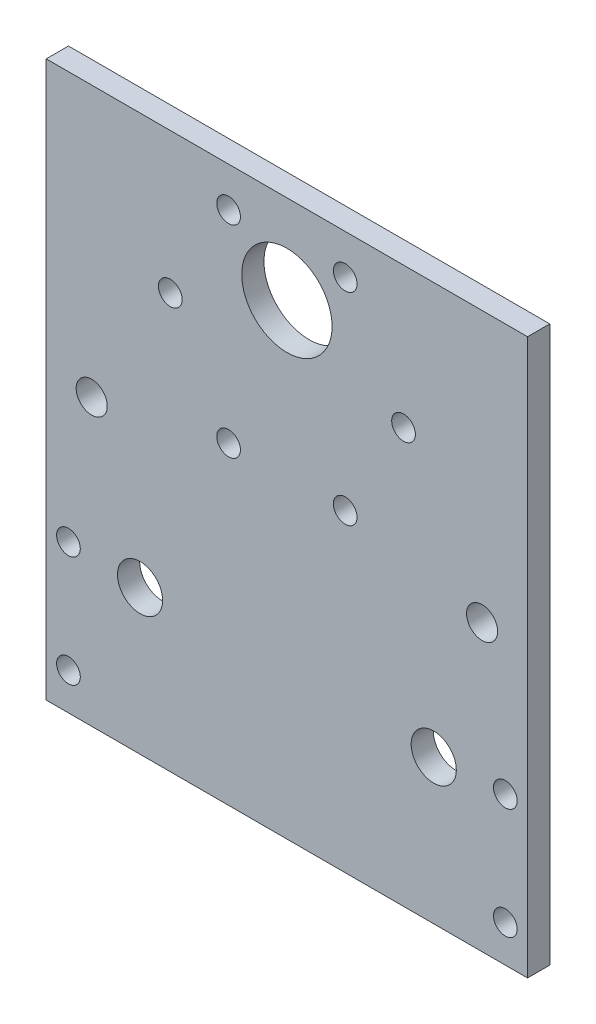
ISO-10303-21;
HEADER;
FILE_DESCRIPTION(('STEP AP214'),'2;1');
FILE_NAME('part.step','',(''),(''),'','','');
FILE_SCHEMA(('AUTOMOTIVE_DESIGN { 1 0 10303 214 1 1 1 1 }'));
ENDSEC;
DATA;
#1=APPLICATION_CONTEXT('core data for automotive mechanical design processes');
#2=APPLICATION_PROTOCOL_DEFINITION('international standard','automotive_design',2000,#1);
#3=PRODUCT_CONTEXT('',#1,'mechanical');
#4=PRODUCT('Part','Part','',(#3));
#5=PRODUCT_RELATED_PRODUCT_CATEGORY('part','',(#4));
#6=PRODUCT_DEFINITION_FORMATION('','',#4);
#7=PRODUCT_DEFINITION_CONTEXT('part definition',#1,'design');
#8=PRODUCT_DEFINITION('design','',#6,#7);
#9=PRODUCT_DEFINITION_SHAPE('','',#8);
#10=(LENGTH_UNIT() NAMED_UNIT(*) SI_UNIT(.MILLI.,.METRE.));
#11=(NAMED_UNIT(*) PLANE_ANGLE_UNIT() SI_UNIT($,.RADIAN.));
#12=(NAMED_UNIT(*) SI_UNIT($,.STERADIAN.) SOLID_ANGLE_UNIT());
#13=UNCERTAINTY_MEASURE_WITH_UNIT(LENGTH_MEASURE(1.E-05),#10,'distance_accuracy_value','');
#14=(GEOMETRIC_REPRESENTATION_CONTEXT(3) GLOBAL_UNCERTAINTY_ASSIGNED_CONTEXT((#13)) GLOBAL_UNIT_ASSIGNED_CONTEXT((#10,
#11,#12)) REPRESENTATION_CONTEXT('',''));
#15=CARTESIAN_POINT('',(0.,0.,0.));
#16=DIRECTION('',(0.,0.,1.));
#17=DIRECTION('',(1.,0.,0.));
#18=AXIS2_PLACEMENT_3D('',#15,#16,#17);
#19=CARTESIAN_POINT('',(32.5,0.,3.));
#20=DIRECTION('',(1.,0.,0.));
#21=DIRECTION('',(0.,0.,-1.));
#22=AXIS2_PLACEMENT_3D('',#19,#20,#21);
#23=PLANE('',#22);
#24=DIRECTION('',(0.,-1.,0.));
#25=VECTOR('',#24,1.);
#26=CARTESIAN_POINT('',(32.5,0.,0.));
#27=LINE('',#26,#25);
#28=CARTESIAN_POINT('',(32.5,62.5,0.));
#29=VERTEX_POINT('',#28);
#30=CARTESIAN_POINT('',(32.5,-12.5,0.));
#31=VERTEX_POINT('',#30);
#32=EDGE_CURVE('E159',#29,#31,#27,.T.);
#33=ORIENTED_EDGE('',*,*,#32,.F.);
#34=DIRECTION('',(0.,0.,-1.));
#35=VECTOR('',#34,1.);
#36=CARTESIAN_POINT('',(32.5,62.5,3.));
#37=LINE('',#36,#35);
#38=CARTESIAN_POINT('',(32.5,62.5,3.));
#39=VERTEX_POINT('',#38);
#40=EDGE_CURVE('E108',#39,#29,#37,.T.);
#41=ORIENTED_EDGE('',*,*,#40,.F.);
#42=DIRECTION('',(0.,-1.,0.));
#43=VECTOR('',#42,1.);
#44=CARTESIAN_POINT('',(32.5,0.,3.));
#45=LINE('',#44,#43);
#46=CARTESIAN_POINT('',(32.5,-12.5,3.));
#47=VERTEX_POINT('',#46);
#48=EDGE_CURVE('E99',#39,#47,#45,.T.);
#49=ORIENTED_EDGE('',*,*,#48,.T.);
#50=DIRECTION('',(0.,0.,-1.));
#51=VECTOR('',#50,1.);
#52=CARTESIAN_POINT('',(32.5,-12.5,3.));
#53=LINE('',#52,#51);
#54=EDGE_CURVE('E58',#47,#31,#53,.T.);
#55=ORIENTED_EDGE('',*,*,#54,.T.);
#56=EDGE_LOOP('',(#33,#41,#49,#55));
#57=FACE_BOUND('',#56,.T.);
#58=ADVANCED_FACE('F48',(#57),#23,.T.);
#59=CARTESIAN_POINT('',(-32.5,0.,3.));
#60=DIRECTION('',(1.,0.,0.));
#61=DIRECTION('',(0.,0.,-1.));
#62=AXIS2_PLACEMENT_3D('',#59,#60,#61);
#63=PLANE('',#62);
#64=DIRECTION('',(0.,-1.,0.));
#65=VECTOR('',#64,1.);
#66=CARTESIAN_POINT('',(-32.5,0.,0.));
#67=LINE('',#66,#65);
#68=CARTESIAN_POINT('',(-32.5,62.5,0.));
#69=VERTEX_POINT('',#68);
#70=CARTESIAN_POINT('',(-32.5,-12.5,0.));
#71=VERTEX_POINT('',#70);
#72=EDGE_CURVE('E82',#69,#71,#67,.T.);
#73=ORIENTED_EDGE('',*,*,#72,.T.);
#74=DIRECTION('',(0.,0.,-1.));
#75=VECTOR('',#74,1.);
#76=CARTESIAN_POINT('',(-32.5,-12.5,3.));
#77=LINE('',#76,#75);
#78=CARTESIAN_POINT('',(-32.5,-12.5,3.));
#79=VERTEX_POINT('',#78);
#80=EDGE_CURVE('E12',#79,#71,#77,.T.);
#81=ORIENTED_EDGE('',*,*,#80,.F.);
#82=DIRECTION('',(0.,-1.,0.));
#83=VECTOR('',#82,1.);
#84=CARTESIAN_POINT('',(-32.5,0.,3.));
#85=LINE('',#84,#83);
#86=CARTESIAN_POINT('',(-32.5,62.5,3.));
#87=VERTEX_POINT('',#86);
#88=EDGE_CURVE('E94',#87,#79,#85,.T.);
#89=ORIENTED_EDGE('',*,*,#88,.F.);
#90=DIRECTION('',(0.,0.,1.));
#91=VECTOR('',#90,1.);
#92=CARTESIAN_POINT('',(-32.5,62.5,3.));
#93=LINE('',#92,#91);
#94=EDGE_CURVE('E98',#69,#87,#93,.T.);
#95=ORIENTED_EDGE('',*,*,#94,.F.);
#96=EDGE_LOOP('',(#73,#81,#89,#95));
#97=FACE_BOUND('',#96,.T.);
#98=ADVANCED_FACE('F96',(#97),#63,.F.);
#99=CARTESIAN_POINT('',(-19.83,7.,3.));
#100=DIRECTION('',(0.,0.,-1.));
#101=DIRECTION('',(-1.,0.,0.));
#102=AXIS2_PLACEMENT_3D('',#99,#100,#101);
#103=CYLINDRICAL_SURFACE('',#102,3.05);
#104=CARTESIAN_POINT('',(-19.83,7.,3.));
#105=DIRECTION('',(0.,0.,1.));
#106=DIRECTION('',(1.,0.,0.));
#107=AXIS2_PLACEMENT_3D('',#104,#105,#106);
#108=CIRCLE('',#107,3.05);
#109=CARTESIAN_POINT('',(-16.78,7.,3.));
#110=VERTEX_POINT('',#109);
#111=EDGE_CURVE('E149',#110,#110,#108,.T.);
#112=ORIENTED_EDGE('',*,*,#111,.T.);
#113=EDGE_LOOP('',(#112));
#114=FACE_BOUND('',#113,.T.);
#115=CARTESIAN_POINT('',(-19.83,7.,0.));
#116=DIRECTION('',(0.,0.,1.));
#117=DIRECTION('',(1.,0.,0.));
#118=AXIS2_PLACEMENT_3D('',#115,#116,#117);
#119=CIRCLE('',#118,3.05);
#120=CARTESIAN_POINT('',(-16.78,7.,0.));
#121=VERTEX_POINT('',#120);
#122=EDGE_CURVE('E156',#121,#121,#119,.T.);
#123=ORIENTED_EDGE('',*,*,#122,.F.);
#124=EDGE_LOOP('',(#123));
#125=FACE_BOUND('',#124,.T.);
#126=ADVANCED_FACE('F189',(#114,#125),#103,.F.);
#127=CARTESIAN_POINT('',(19.83,7.,3.));
#128=DIRECTION('',(0.,0.,-1.));
#129=DIRECTION('',(-1.,0.,0.));
#130=AXIS2_PLACEMENT_3D('',#127,#128,#129);
#131=CYLINDRICAL_SURFACE('',#130,3.05);
#132=CARTESIAN_POINT('',(19.83,7.,3.));
#133=DIRECTION('',(0.,0.,1.));
#134=DIRECTION('',(1.,0.,0.));
#135=AXIS2_PLACEMENT_3D('',#132,#133,#134);
#136=CIRCLE('',#135,3.05);
#137=CARTESIAN_POINT('',(22.88,7.,3.));
#138=VERTEX_POINT('',#137);
#139=EDGE_CURVE('E146',#138,#138,#136,.T.);
#140=ORIENTED_EDGE('',*,*,#139,.T.);
#141=EDGE_LOOP('',(#140));
#142=FACE_BOUND('',#141,.T.);
#143=CARTESIAN_POINT('',(19.83,7.,0.));
#144=DIRECTION('',(0.,0.,1.));
#145=DIRECTION('',(1.,0.,0.));
#146=AXIS2_PLACEMENT_3D('',#143,#144,#145);
#147=CIRCLE('',#146,3.05);
#148=CARTESIAN_POINT('',(22.88,7.,0.));
#149=VERTEX_POINT('',#148);
#150=EDGE_CURVE('E143',#149,#149,#147,.T.);
#151=ORIENTED_EDGE('',*,*,#150,.F.);
#152=EDGE_LOOP('',(#151));
#153=FACE_BOUND('',#152,.T.);
#154=ADVANCED_FACE('F50',(#142,#153),#131,.F.);
#155=CARTESIAN_POINT('',(0.,-12.5,3.));
#156=DIRECTION('',(0.,1.,0.));
#157=DIRECTION('',(-1.,0.,0.));
#158=AXIS2_PLACEMENT_3D('',#155,#156,#157);
#159=PLANE('',#158);
#160=DIRECTION('',(1.,0.,0.));
#161=VECTOR('',#160,1.);
#162=CARTESIAN_POINT('',(0.,-12.5,0.));
#163=LINE('',#162,#161);
#164=EDGE_CURVE('E77',#71,#31,#163,.T.);
#165=ORIENTED_EDGE('',*,*,#164,.T.);
#166=ORIENTED_EDGE('',*,*,#54,.F.);
#167=DIRECTION('',(1.,0.,0.));
#168=VECTOR('',#167,1.);
#169=CARTESIAN_POINT('',(0.,-12.5,3.));
#170=LINE('',#169,#168);
#171=EDGE_CURVE('E66',#79,#47,#170,.T.);
#172=ORIENTED_EDGE('',*,*,#171,.F.);
#173=ORIENTED_EDGE('',*,*,#80,.T.);
#174=EDGE_LOOP('',(#165,#166,#172,#173));
#175=FACE_BOUND('',#174,.T.);
#176=ADVANCED_FACE('F165',(#175),#159,.F.);
#177=CARTESIAN_POINT('',(0.,0.,3.));
#178=DIRECTION('',(0.,0.,1.));
#179=DIRECTION('',(1.,0.,0.));
#180=AXIS2_PLACEMENT_3D('',#177,#178,#179);
#181=PLANE('',#180);
#182=CARTESIAN_POINT('',(-26.36,26.,3.));
#183=DIRECTION('',(0.,0.,1.));
#184=DIRECTION('',(1.,0.,0.));
#185=AXIS2_PLACEMENT_3D('',#182,#183,#184);
#186=CIRCLE('',#185,2.1);
#187=CARTESIAN_POINT('',(-24.26,26.,3.));
#188=VERTEX_POINT('',#187);
#189=EDGE_CURVE('E358',#188,#188,#186,.T.);
#190=ORIENTED_EDGE('',*,*,#189,.F.);
#191=EDGE_LOOP('',(#190));
#192=FACE_BOUND('',#191,.T.);
#193=CARTESIAN_POINT('',(26.3608960252373,25.99999999999,3.));
#194=DIRECTION('',(0.,0.,1.));
#195=DIRECTION('',(1.,0.,0.));
#196=AXIS2_PLACEMENT_3D('',#193,#194,#195);
#197=CIRCLE('',#196,2.1);
#198=CARTESIAN_POINT('',(28.4608960252373,25.99999999999,3.));
#199=VERTEX_POINT('',#198);
#200=EDGE_CURVE('E362',#199,#199,#197,.T.);
#201=ORIENTED_EDGE('',*,*,#200,.F.);
#202=EDGE_LOOP('',(#201));
#203=FACE_BOUND('',#202,.T.);
#204=CARTESIAN_POINT('',(7.87500000000003,29.8600998903951,3.));
#205=DIRECTION('',(0.,0.,1.));
#206=DIRECTION('',(1.,0.,0.));
#207=AXIS2_PLACEMENT_3D('',#204,#205,#206);
#208=CIRCLE('',#207,1.6);
#209=CARTESIAN_POINT('',(9.47500000000003,29.8600998903951,3.));
#210=VERTEX_POINT('',#209);
#211=EDGE_CURVE('E112',#210,#210,#208,.F.);
#212=ORIENTED_EDGE('',*,*,#211,.T.);
#213=EDGE_LOOP('',(#212));
#214=FACE_BOUND('',#213,.T.);
#215=CARTESIAN_POINT('',(-7.87500000000001,29.8600998903951,3.));
#216=DIRECTION('',(0.,0.,1.));
#217=DIRECTION('',(1.,0.,0.));
#218=AXIS2_PLACEMENT_3D('',#215,#216,#217);
#219=CIRCLE('',#218,1.6);
#220=CARTESIAN_POINT('',(-6.27500000000001,29.8600998903951,3.));
#221=VERTEX_POINT('',#220);
#222=EDGE_CURVE('E115',#221,#221,#219,.F.);
#223=ORIENTED_EDGE('',*,*,#222,.T.);
#224=EDGE_LOOP('',(#223));
#225=FACE_BOUND('',#224,.T.);
#226=CARTESIAN_POINT('',(0.,50.5,3.));
#227=DIRECTION('',(0.,0.,1.));
#228=DIRECTION('',(1.,0.,0.));
#229=AXIS2_PLACEMENT_3D('',#226,#227,#228);
#230=CIRCLE('',#229,6.1);
#231=CARTESIAN_POINT('',(6.1,50.5,3.));
#232=VERTEX_POINT('',#231);
#233=EDGE_CURVE('E401',#232,#232,#230,.F.);
#234=ORIENTED_EDGE('',*,*,#233,.T.);
#235=EDGE_LOOP('',(#234));
#236=FACE_BOUND('',#235,.T.);
#237=CARTESIAN_POINT('',(-7.87499999999992,57.139900109605,3.));
#238=DIRECTION('',(0.,0.,1.));
#239=DIRECTION('',(1.,0.,0.));
#240=AXIS2_PLACEMENT_3D('',#237,#238,#239);
#241=CIRCLE('',#240,1.6);
#242=CARTESIAN_POINT('',(-6.27499999999992,57.139900109605,3.));
#243=VERTEX_POINT('',#242);
#244=EDGE_CURVE('E398',#243,#243,#241,.F.);
#245=ORIENTED_EDGE('',*,*,#244,.T.);
#246=EDGE_LOOP('',(#245));
#247=FACE_BOUND('',#246,.T.);
#248=CARTESIAN_POINT('',(-15.75,43.5,3.));
#249=DIRECTION('',(0.,0.,1.));
#250=DIRECTION('',(1.,0.,0.));
#251=AXIS2_PLACEMENT_3D('',#248,#249,#250);
#252=CIRCLE('',#251,1.6);
#253=CARTESIAN_POINT('',(-14.15,43.5,3.));
#254=VERTEX_POINT('',#253);
#255=EDGE_CURVE('E395',#254,#254,#252,.F.);
#256=ORIENTED_EDGE('',*,*,#255,.T.);
#257=EDGE_LOOP('',(#256));
#258=FACE_BOUND('',#257,.T.);
#259=CARTESIAN_POINT('',(15.75,43.5000000000001,3.));
#260=DIRECTION('',(0.,0.,1.));
#261=DIRECTION('',(1.,0.,0.));
#262=AXIS2_PLACEMENT_3D('',#259,#260,#261);
#263=CIRCLE('',#262,1.6);
#264=CARTESIAN_POINT('',(17.35,43.5000000000001,3.));
#265=VERTEX_POINT('',#264);
#266=EDGE_CURVE('E392',#265,#265,#263,.F.);
#267=ORIENTED_EDGE('',*,*,#266,.T.);
#268=EDGE_LOOP('',(#267));
#269=FACE_BOUND('',#268,.T.);
#270=CARTESIAN_POINT('',(7.87499999999992,57.139900109605,3.));
#271=DIRECTION('',(0.,0.,1.));
#272=DIRECTION('',(1.,0.,0.));
#273=AXIS2_PLACEMENT_3D('',#270,#271,#272);
#274=CIRCLE('',#273,1.6);
#275=CARTESIAN_POINT('',(9.47499999999992,57.139900109605,3.));
#276=VERTEX_POINT('',#275);
#277=EDGE_CURVE('E389',#276,#276,#274,.F.);
#278=ORIENTED_EDGE('',*,*,#277,.T.);
#279=EDGE_LOOP('',(#278));
#280=FACE_BOUND('',#279,.T.);
#281=CARTESIAN_POINT('',(-29.5,-7.5,3.));
#282=DIRECTION('',(0.,0.,1.));
#283=DIRECTION('',(1.,0.,0.));
#284=AXIS2_PLACEMENT_3D('',#281,#282,#283);
#285=CIRCLE('',#284,1.6);
#286=CARTESIAN_POINT('',(-27.9,-7.5,3.));
#287=VERTEX_POINT('',#286);
#288=EDGE_CURVE('E132',#287,#287,#285,.T.);
#289=ORIENTED_EDGE('',*,*,#288,.F.);
#290=EDGE_LOOP('',(#289));
#291=FACE_BOUND('',#290,.T.);
#292=CARTESIAN_POINT('',(29.5,7.5,3.));
#293=DIRECTION('',(0.,0.,1.));
#294=DIRECTION('',(1.,0.,0.));
#295=AXIS2_PLACEMENT_3D('',#292,#293,#294);
#296=CIRCLE('',#295,1.6);
#297=CARTESIAN_POINT('',(31.1,7.5,3.));
#298=VERTEX_POINT('',#297);
#299=EDGE_CURVE('E125',#298,#298,#296,.T.);
#300=ORIENTED_EDGE('',*,*,#299,.F.);
#301=EDGE_LOOP('',(#300));
#302=FACE_BOUND('',#301,.T.);
#303=CARTESIAN_POINT('',(29.5,-7.5,3.));
#304=DIRECTION('',(0.,0.,1.));
#305=DIRECTION('',(1.,0.,0.));
#306=AXIS2_PLACEMENT_3D('',#303,#304,#305);
#307=CIRCLE('',#306,1.6);
#308=CARTESIAN_POINT('',(31.1,-7.5,3.));
#309=VERTEX_POINT('',#308);
#310=EDGE_CURVE('E121',#309,#309,#307,.T.);
#311=ORIENTED_EDGE('',*,*,#310,.F.);
#312=EDGE_LOOP('',(#311));
#313=FACE_BOUND('',#312,.T.);
#314=CARTESIAN_POINT('',(-29.5,7.5,3.));
#315=DIRECTION('',(0.,0.,1.));
#316=DIRECTION('',(1.,0.,0.));
#317=AXIS2_PLACEMENT_3D('',#314,#315,#316);
#318=CIRCLE('',#317,1.6);
#319=CARTESIAN_POINT('',(-27.9,7.5,3.));
#320=VERTEX_POINT('',#319);
#321=EDGE_CURVE('E131',#320,#320,#318,.T.);
#322=ORIENTED_EDGE('',*,*,#321,.F.);
#323=EDGE_LOOP('',(#322));
#324=FACE_BOUND('',#323,.T.);
#325=ORIENTED_EDGE('',*,*,#139,.F.);
#326=EDGE_LOOP('',(#325));
#327=FACE_BOUND('',#326,.T.);
#328=ORIENTED_EDGE('',*,*,#111,.F.);
#329=EDGE_LOOP('',(#328));
#330=FACE_BOUND('',#329,.T.);
#331=ORIENTED_EDGE('',*,*,#48,.F.);
#332=DIRECTION('',(1.,0.,0.));
#333=VECTOR('',#332,1.);
#334=CARTESIAN_POINT('',(-32.5,62.5,3.));
#335=LINE('',#334,#333);
#336=EDGE_CURVE('E102',#87,#39,#335,.T.);
#337=ORIENTED_EDGE('',*,*,#336,.F.);
#338=ORIENTED_EDGE('',*,*,#88,.T.);
#339=ORIENTED_EDGE('',*,*,#171,.T.);
#340=EDGE_LOOP('',(#331,#337,#338,#339));
#341=FACE_BOUND('',#340,.T.);
#342=ADVANCED_FACE('F103',(#192,#203,#214,#225,#236,#247,#258,#269,#280,#291,#302,#313,#324,
#327,#330,#341),#181,.T.);
#343=CARTESIAN_POINT('',(0.,0.,0.));
#344=DIRECTION('',(0.,0.,1.));
#345=DIRECTION('',(1.,0.,0.));
#346=AXIS2_PLACEMENT_3D('',#343,#344,#345);
#347=PLANE('',#346);
#348=CARTESIAN_POINT('',(-26.36,26.,0.));
#349=DIRECTION('',(0.,0.,1.));
#350=DIRECTION('',(1.,0.,0.));
#351=AXIS2_PLACEMENT_3D('',#348,#349,#350);
#352=CIRCLE('',#351,2.1);
#353=CARTESIAN_POINT('',(-24.26,26.,0.));
#354=VERTEX_POINT('',#353);
#355=EDGE_CURVE('E52',#354,#354,#352,.T.);
#356=ORIENTED_EDGE('',*,*,#355,.T.);
#357=EDGE_LOOP('',(#356));
#358=FACE_BOUND('',#357,.T.);
#359=CARTESIAN_POINT('',(26.3608960252373,25.99999999999,0.));
#360=DIRECTION('',(0.,0.,-1.));
#361=DIRECTION('',(-1.,0.,0.));
#362=AXIS2_PLACEMENT_3D('',#359,#360,#361);
#363=CIRCLE('',#362,2.1);
#364=CARTESIAN_POINT('',(24.2608960252373,25.99999999999,0.));
#365=VERTEX_POINT('',#364);
#366=EDGE_CURVE('E360',#365,#365,#363,.T.);
#367=ORIENTED_EDGE('',*,*,#366,.F.);
#368=EDGE_LOOP('',(#367));
#369=FACE_BOUND('',#368,.T.);
#370=CARTESIAN_POINT('',(7.87500000000003,29.8600998903951,0.));
#371=DIRECTION('',(0.,0.,1.));
#372=DIRECTION('',(1.,0.,0.));
#373=AXIS2_PLACEMENT_3D('',#370,#371,#372);
#374=CIRCLE('',#373,1.6);
#375=CARTESIAN_POINT('',(9.47500000000003,29.8600998903951,0.));
#376=VERTEX_POINT('',#375);
#377=EDGE_CURVE('E368',#376,#376,#374,.T.);
#378=ORIENTED_EDGE('',*,*,#377,.T.);
#379=EDGE_LOOP('',(#378));
#380=FACE_BOUND('',#379,.T.);
#381=CARTESIAN_POINT('',(-7.87500000000001,29.8600998903951,0.));
#382=DIRECTION('',(0.,0.,1.));
#383=DIRECTION('',(1.,0.,0.));
#384=AXIS2_PLACEMENT_3D('',#381,#382,#383);
#385=CIRCLE('',#384,1.6);
#386=CARTESIAN_POINT('',(-6.27500000000001,29.8600998903951,0.));
#387=VERTEX_POINT('',#386);
#388=EDGE_CURVE('E376',#387,#387,#385,.T.);
#389=ORIENTED_EDGE('',*,*,#388,.T.);
#390=EDGE_LOOP('',(#389));
#391=FACE_BOUND('',#390,.T.);
#392=CARTESIAN_POINT('',(0.,50.5,0.));
#393=DIRECTION('',(0.,0.,1.));
#394=DIRECTION('',(1.,0.,0.));
#395=AXIS2_PLACEMENT_3D('',#392,#393,#394);
#396=CIRCLE('',#395,6.1);
#397=CARTESIAN_POINT('',(6.1,50.5,0.));
#398=VERTEX_POINT('',#397);
#399=EDGE_CURVE('E377',#398,#398,#396,.T.);
#400=ORIENTED_EDGE('',*,*,#399,.T.);
#401=EDGE_LOOP('',(#400));
#402=FACE_BOUND('',#401,.T.);
#403=CARTESIAN_POINT('',(-7.87499999999992,57.139900109605,0.));
#404=DIRECTION('',(0.,0.,1.));
#405=DIRECTION('',(1.,0.,0.));
#406=AXIS2_PLACEMENT_3D('',#403,#404,#405);
#407=CIRCLE('',#406,1.6);
#408=CARTESIAN_POINT('',(-6.27499999999992,57.139900109605,0.));
#409=VERTEX_POINT('',#408);
#410=EDGE_CURVE('E372',#409,#409,#407,.T.);
#411=ORIENTED_EDGE('',*,*,#410,.T.);
#412=EDGE_LOOP('',(#411));
#413=FACE_BOUND('',#412,.T.);
#414=CARTESIAN_POINT('',(-15.75,43.5,0.));
#415=DIRECTION('',(0.,0.,1.));
#416=DIRECTION('',(1.,0.,0.));
#417=AXIS2_PLACEMENT_3D('',#414,#415,#416);
#418=CIRCLE('',#417,1.6);
#419=CARTESIAN_POINT('',(-14.15,43.5,0.));
#420=VERTEX_POINT('',#419);
#421=EDGE_CURVE('E369',#420,#420,#418,.T.);
#422=ORIENTED_EDGE('',*,*,#421,.T.);
#423=EDGE_LOOP('',(#422));
#424=FACE_BOUND('',#423,.T.);
#425=CARTESIAN_POINT('',(15.75,43.5000000000001,0.));
#426=DIRECTION('',(0.,0.,1.));
#427=DIRECTION('',(1.,0.,0.));
#428=AXIS2_PLACEMENT_3D('',#425,#426,#427);
#429=CIRCLE('',#428,1.6);
#430=CARTESIAN_POINT('',(17.35,43.5000000000001,0.));
#431=VERTEX_POINT('',#430);
#432=EDGE_CURVE('E373',#431,#431,#429,.T.);
#433=ORIENTED_EDGE('',*,*,#432,.T.);
#434=EDGE_LOOP('',(#433));
#435=FACE_BOUND('',#434,.T.);
#436=CARTESIAN_POINT('',(7.87499999999992,57.139900109605,0.));
#437=DIRECTION('',(0.,0.,1.));
#438=DIRECTION('',(1.,0.,0.));
#439=AXIS2_PLACEMENT_3D('',#436,#437,#438);
#440=CIRCLE('',#439,1.6);
#441=CARTESIAN_POINT('',(9.47499999999992,57.139900109605,0.));
#442=VERTEX_POINT('',#441);
#443=EDGE_CURVE('E380',#442,#442,#440,.T.);
#444=ORIENTED_EDGE('',*,*,#443,.T.);
#445=EDGE_LOOP('',(#444));
#446=FACE_BOUND('',#445,.T.);
#447=CARTESIAN_POINT('',(-29.5,-7.5,0.));
#448=DIRECTION('',(0.,0.,1.));
#449=DIRECTION('',(1.,0.,0.));
#450=AXIS2_PLACEMENT_3D('',#447,#448,#449);
#451=CIRCLE('',#450,1.6);
#452=CARTESIAN_POINT('',(-27.9,-7.5,0.));
#453=VERTEX_POINT('',#452);
#454=EDGE_CURVE('E128',#453,#453,#451,.T.);
#455=ORIENTED_EDGE('',*,*,#454,.T.);
#456=EDGE_LOOP('',(#455));
#457=FACE_BOUND('',#456,.T.);
#458=CARTESIAN_POINT('',(29.5,7.5,0.));
#459=DIRECTION('',(0.,0.,1.));
#460=DIRECTION('',(1.,0.,0.));
#461=AXIS2_PLACEMENT_3D('',#458,#459,#460);
#462=CIRCLE('',#461,1.6);
#463=CARTESIAN_POINT('',(31.1,7.5,0.));
#464=VERTEX_POINT('',#463);
#465=EDGE_CURVE('E135',#464,#464,#462,.T.);
#466=ORIENTED_EDGE('',*,*,#465,.T.);
#467=EDGE_LOOP('',(#466));
#468=FACE_BOUND('',#467,.T.);
#469=CARTESIAN_POINT('',(29.5,-7.5,0.));
#470=DIRECTION('',(0.,0.,1.));
#471=DIRECTION('',(1.,0.,0.));
#472=AXIS2_PLACEMENT_3D('',#469,#470,#471);
#473=CIRCLE('',#472,1.6);
#474=CARTESIAN_POINT('',(31.1,-7.5,0.));
#475=VERTEX_POINT('',#474);
#476=EDGE_CURVE('E122',#475,#475,#473,.T.);
#477=ORIENTED_EDGE('',*,*,#476,.T.);
#478=EDGE_LOOP('',(#477));
#479=FACE_BOUND('',#478,.T.);
#480=CARTESIAN_POINT('',(-29.5,7.5,0.));
#481=DIRECTION('',(0.,0.,1.));
#482=DIRECTION('',(1.,0.,0.));
#483=AXIS2_PLACEMENT_3D('',#480,#481,#482);
#484=CIRCLE('',#483,1.6);
#485=CARTESIAN_POINT('',(-27.9,7.5,0.));
#486=VERTEX_POINT('',#485);
#487=EDGE_CURVE('E140',#486,#486,#484,.T.);
#488=ORIENTED_EDGE('',*,*,#487,.T.);
#489=EDGE_LOOP('',(#488));
#490=FACE_BOUND('',#489,.T.);
#491=ORIENTED_EDGE('',*,*,#150,.T.);
#492=EDGE_LOOP('',(#491));
#493=FACE_BOUND('',#492,.T.);
#494=ORIENTED_EDGE('',*,*,#122,.T.);
#495=EDGE_LOOP('',(#494));
#496=FACE_BOUND('',#495,.T.);
#497=ORIENTED_EDGE('',*,*,#32,.T.);
#498=ORIENTED_EDGE('',*,*,#164,.F.);
#499=ORIENTED_EDGE('',*,*,#72,.F.);
#500=DIRECTION('',(-1.,0.,0.));
#501=VECTOR('',#500,1.);
#502=CARTESIAN_POINT('',(-32.5,62.5,0.));
#503=LINE('',#502,#501);
#504=EDGE_CURVE('E111',#29,#69,#503,.T.);
#505=ORIENTED_EDGE('',*,*,#504,.F.);
#506=EDGE_LOOP('',(#497,#498,#499,#505));
#507=FACE_BOUND('',#506,.T.);
#508=ADVANCED_FACE('F166',(#358,#369,#380,#391,#402,#413,#424,#435,#446,#457,#468,#479,#490,
#493,#496,#507),#347,.F.);
#509=CARTESIAN_POINT('',(-29.5,7.5,0.));
#510=DIRECTION('',(0.,0.,1.));
#511=DIRECTION('',(1.,0.,0.));
#512=AXIS2_PLACEMENT_3D('',#509,#510,#511);
#513=CYLINDRICAL_SURFACE('',#512,1.6);
#514=ORIENTED_EDGE('',*,*,#487,.F.);
#515=EDGE_LOOP('',(#514));
#516=FACE_BOUND('',#515,.T.);
#517=ORIENTED_EDGE('',*,*,#321,.T.);
#518=EDGE_LOOP('',(#517));
#519=FACE_BOUND('',#518,.T.);
#520=ADVANCED_FACE('F168',(#516,#519),#513,.F.);
#521=CARTESIAN_POINT('',(29.5,-7.5,0.));
#522=DIRECTION('',(0.,0.,1.));
#523=DIRECTION('',(1.,0.,0.));
#524=AXIS2_PLACEMENT_3D('',#521,#522,#523);
#525=CYLINDRICAL_SURFACE('',#524,1.6);
#526=ORIENTED_EDGE('',*,*,#476,.F.);
#527=EDGE_LOOP('',(#526));
#528=FACE_BOUND('',#527,.T.);
#529=ORIENTED_EDGE('',*,*,#310,.T.);
#530=EDGE_LOOP('',(#529));
#531=FACE_BOUND('',#530,.T.);
#532=ADVANCED_FACE('F176',(#528,#531),#525,.F.);
#533=CARTESIAN_POINT('',(29.5,7.5,0.));
#534=DIRECTION('',(0.,0.,1.));
#535=DIRECTION('',(1.,0.,0.));
#536=AXIS2_PLACEMENT_3D('',#533,#534,#535);
#537=CYLINDRICAL_SURFACE('',#536,1.6);
#538=ORIENTED_EDGE('',*,*,#465,.F.);
#539=EDGE_LOOP('',(#538));
#540=FACE_BOUND('',#539,.T.);
#541=ORIENTED_EDGE('',*,*,#299,.T.);
#542=EDGE_LOOP('',(#541));
#543=FACE_BOUND('',#542,.T.);
#544=ADVANCED_FACE('F237',(#540,#543),#537,.F.);
#545=CARTESIAN_POINT('',(-29.5,-7.5,0.));
#546=DIRECTION('',(0.,0.,1.));
#547=DIRECTION('',(1.,0.,0.));
#548=AXIS2_PLACEMENT_3D('',#545,#546,#547);
#549=CYLINDRICAL_SURFACE('',#548,1.6);
#550=ORIENTED_EDGE('',*,*,#454,.F.);
#551=EDGE_LOOP('',(#550));
#552=FACE_BOUND('',#551,.T.);
#553=ORIENTED_EDGE('',*,*,#288,.T.);
#554=EDGE_LOOP('',(#553));
#555=FACE_BOUND('',#554,.T.);
#556=ADVANCED_FACE('F245',(#552,#555),#549,.F.);
#557=CARTESIAN_POINT('',(0.,62.5,0.));
#558=DIRECTION('',(0.,-1.,0.));
#559=DIRECTION('',(0.,0.,-1.));
#560=AXIS2_PLACEMENT_3D('',#557,#558,#559);
#561=PLANE('',#560);
#562=ORIENTED_EDGE('',*,*,#94,.T.);
#563=ORIENTED_EDGE('',*,*,#336,.T.);
#564=ORIENTED_EDGE('',*,*,#40,.T.);
#565=ORIENTED_EDGE('',*,*,#504,.T.);
#566=EDGE_LOOP('',(#562,#563,#564,#565));
#567=FACE_BOUND('',#566,.T.);
#568=ADVANCED_FACE('F110',(#567),#561,.F.);
#569=CARTESIAN_POINT('',(7.87499999999992,57.139900109605,40.));
#570=DIRECTION('',(0.,0.,-1.));
#571=DIRECTION('',(-1.,0.,0.));
#572=AXIS2_PLACEMENT_3D('',#569,#570,#571);
#573=CYLINDRICAL_SURFACE('',#572,1.6);
#574=ORIENTED_EDGE('',*,*,#277,.F.);
#575=EDGE_LOOP('',(#574));
#576=FACE_BOUND('',#575,.T.);
#577=ORIENTED_EDGE('',*,*,#443,.F.);
#578=EDGE_LOOP('',(#577));
#579=FACE_BOUND('',#578,.T.);
#580=ADVANCED_FACE('F260',(#576,#579),#573,.F.);
#581=CARTESIAN_POINT('',(15.75,43.5000000000001,40.));
#582=DIRECTION('',(0.,0.,-1.));
#583=DIRECTION('',(-1.,0.,0.));
#584=AXIS2_PLACEMENT_3D('',#581,#582,#583);
#585=CYLINDRICAL_SURFACE('',#584,1.6);
#586=ORIENTED_EDGE('',*,*,#266,.F.);
#587=EDGE_LOOP('',(#586));
#588=FACE_BOUND('',#587,.T.);
#589=ORIENTED_EDGE('',*,*,#432,.F.);
#590=EDGE_LOOP('',(#589));
#591=FACE_BOUND('',#590,.T.);
#592=ADVANCED_FACE('F267',(#588,#591),#585,.F.);
#593=CARTESIAN_POINT('',(-15.75,43.5,40.));
#594=DIRECTION('',(0.,0.,-1.));
#595=DIRECTION('',(-1.,0.,0.));
#596=AXIS2_PLACEMENT_3D('',#593,#594,#595);
#597=CYLINDRICAL_SURFACE('',#596,1.6);
#598=ORIENTED_EDGE('',*,*,#255,.F.);
#599=EDGE_LOOP('',(#598));
#600=FACE_BOUND('',#599,.T.);
#601=ORIENTED_EDGE('',*,*,#421,.F.);
#602=EDGE_LOOP('',(#601));
#603=FACE_BOUND('',#602,.T.);
#604=ADVANCED_FACE('F275',(#600,#603),#597,.F.);
#605=CARTESIAN_POINT('',(-7.87499999999992,57.139900109605,40.));
#606=DIRECTION('',(0.,0.,-1.));
#607=DIRECTION('',(-1.,0.,0.));
#608=AXIS2_PLACEMENT_3D('',#605,#606,#607);
#609=CYLINDRICAL_SURFACE('',#608,1.6);
#610=ORIENTED_EDGE('',*,*,#244,.F.);
#611=EDGE_LOOP('',(#610));
#612=FACE_BOUND('',#611,.T.);
#613=ORIENTED_EDGE('',*,*,#410,.F.);
#614=EDGE_LOOP('',(#613));
#615=FACE_BOUND('',#614,.T.);
#616=ADVANCED_FACE('F283',(#612,#615),#609,.F.);
#617=CARTESIAN_POINT('',(0.,50.5,40.));
#618=DIRECTION('',(0.,0.,-1.));
#619=DIRECTION('',(-1.,0.,0.));
#620=AXIS2_PLACEMENT_3D('',#617,#618,#619);
#621=CYLINDRICAL_SURFACE('',#620,6.1);
#622=ORIENTED_EDGE('',*,*,#233,.F.);
#623=EDGE_LOOP('',(#622));
#624=FACE_BOUND('',#623,.T.);
#625=ORIENTED_EDGE('',*,*,#399,.F.);
#626=EDGE_LOOP('',(#625));
#627=FACE_BOUND('',#626,.T.);
#628=ADVANCED_FACE('F291',(#624,#627),#621,.F.);
#629=CARTESIAN_POINT('',(-7.87500000000001,29.8600998903951,40.));
#630=DIRECTION('',(0.,0.,-1.));
#631=DIRECTION('',(-1.,0.,0.));
#632=AXIS2_PLACEMENT_3D('',#629,#630,#631);
#633=CYLINDRICAL_SURFACE('',#632,1.6);
#634=ORIENTED_EDGE('',*,*,#222,.F.);
#635=EDGE_LOOP('',(#634));
#636=FACE_BOUND('',#635,.T.);
#637=ORIENTED_EDGE('',*,*,#388,.F.);
#638=EDGE_LOOP('',(#637));
#639=FACE_BOUND('',#638,.T.);
#640=ADVANCED_FACE('F299',(#636,#639),#633,.F.);
#641=CARTESIAN_POINT('',(7.87500000000003,29.8600998903951,40.));
#642=DIRECTION('',(0.,0.,-1.));
#643=DIRECTION('',(-1.,0.,0.));
#644=AXIS2_PLACEMENT_3D('',#641,#642,#643);
#645=CYLINDRICAL_SURFACE('',#644,1.6);
#646=ORIENTED_EDGE('',*,*,#211,.F.);
#647=EDGE_LOOP('',(#646));
#648=FACE_BOUND('',#647,.T.);
#649=ORIENTED_EDGE('',*,*,#377,.F.);
#650=EDGE_LOOP('',(#649));
#651=FACE_BOUND('',#650,.T.);
#652=ADVANCED_FACE('F307',(#648,#651),#645,.F.);
#653=CARTESIAN_POINT('',(26.3608960252373,25.99999999999,10.));
#654=DIRECTION('',(0.,0.,-1.));
#655=DIRECTION('',(-1.,0.,0.));
#656=AXIS2_PLACEMENT_3D('',#653,#654,#655);
#657=CYLINDRICAL_SURFACE('',#656,2.1);
#658=ORIENTED_EDGE('',*,*,#200,.T.);
#659=EDGE_LOOP('',(#658));
#660=FACE_BOUND('',#659,.T.);
#661=ORIENTED_EDGE('',*,*,#366,.T.);
#662=EDGE_LOOP('',(#661));
#663=FACE_BOUND('',#662,.T.);
#664=ADVANCED_FACE('F315',(#660,#663),#657,.F.);
#665=CARTESIAN_POINT('',(-26.36,26.,-7.));
#666=DIRECTION('',(0.,0.,1.));
#667=DIRECTION('',(1.,0.,0.));
#668=AXIS2_PLACEMENT_3D('',#665,#666,#667);
#669=CYLINDRICAL_SURFACE('',#668,2.1);
#670=ORIENTED_EDGE('',*,*,#189,.T.);
#671=EDGE_LOOP('',(#670));
#672=FACE_BOUND('',#671,.T.);
#673=ORIENTED_EDGE('',*,*,#355,.F.);
#674=EDGE_LOOP('',(#673));
#675=FACE_BOUND('',#674,.T.);
#676=ADVANCED_FACE('F322',(#672,#675),#669,.F.);
#677=CLOSED_SHELL('',(#58,#98,#126,#154,#176,#342,#508,#520,#532,#544,#556,#568,#580,#592,#604,
#616,#628,#640,#652,#664,#676));
#678=MANIFOLD_SOLID_BREP('B2',#677);
#679=ADVANCED_BREP_SHAPE_REPRESENTATION('',(#18,#678),#14);
#680=SHAPE_DEFINITION_REPRESENTATION(#9,#679);
ENDSEC;
END-ISO-10303-21;
